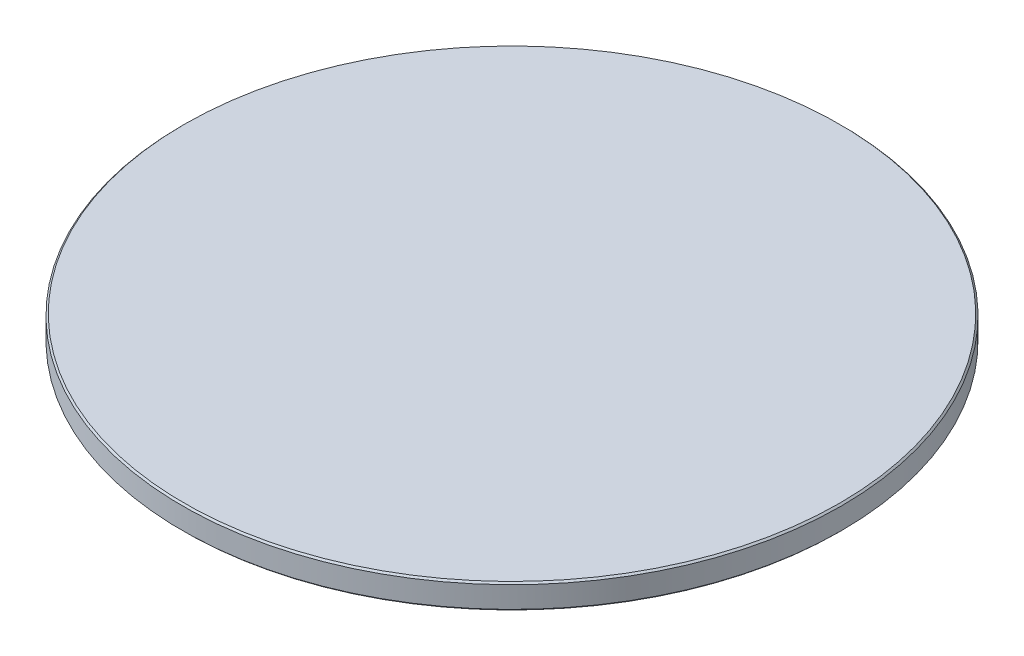
ISO-10303-21;
HEADER;
FILE_DESCRIPTION(('STEP AP214'),'2;1');
FILE_NAME('part.step','',(''),(''),'','','');
FILE_SCHEMA(('AUTOMOTIVE_DESIGN { 1 0 10303 214 1 1 1 1 }'));
ENDSEC;
DATA;
#1=APPLICATION_CONTEXT('core data for automotive mechanical design processes');
#2=APPLICATION_PROTOCOL_DEFINITION('international standard','automotive_design',2000,#1);
#3=PRODUCT_CONTEXT('',#1,'mechanical');
#4=PRODUCT('Part','Part','',(#3));
#5=PRODUCT_RELATED_PRODUCT_CATEGORY('part','',(#4));
#6=PRODUCT_DEFINITION_FORMATION('','',#4);
#7=PRODUCT_DEFINITION_CONTEXT('part definition',#1,'design');
#8=PRODUCT_DEFINITION('design','',#6,#7);
#9=PRODUCT_DEFINITION_SHAPE('','',#8);
#10=(LENGTH_UNIT() NAMED_UNIT(*) SI_UNIT(.MILLI.,.METRE.));
#11=(NAMED_UNIT(*) PLANE_ANGLE_UNIT() SI_UNIT($,.RADIAN.));
#12=(NAMED_UNIT(*) SI_UNIT($,.STERADIAN.) SOLID_ANGLE_UNIT());
#13=UNCERTAINTY_MEASURE_WITH_UNIT(LENGTH_MEASURE(1.E-05),#10,'distance_accuracy_value','');
#14=(GEOMETRIC_REPRESENTATION_CONTEXT(3) GLOBAL_UNCERTAINTY_ASSIGNED_CONTEXT((#13)) GLOBAL_UNIT_ASSIGNED_CONTEXT((#10,
#11,#12)) REPRESENTATION_CONTEXT('',''));
#15=CARTESIAN_POINT('',(0.,0.,0.));
#16=DIRECTION('',(0.,0.,1.));
#17=DIRECTION('',(1.,0.,0.));
#18=AXIS2_PLACEMENT_3D('',#15,#16,#17);
#19=CARTESIAN_POINT('',(0.,2.99999999999999,0.));
#20=DIRECTION('',(0.,1.,0.));
#21=DIRECTION('',(-1.,0.,0.));
#22=AXIS2_PLACEMENT_3D('',#19,#20,#21);
#23=PLANE('',#22);
#24=CARTESIAN_POINT('',(0.,2.99999999999999,0.));
#25=DIRECTION('',(0.,1.,0.));
#26=DIRECTION('',(-1.,0.,0.));
#27=AXIS2_PLACEMENT_3D('',#24,#25,#26);
#28=CIRCLE('',#27,39.8);
#29=CARTESIAN_POINT('',(-39.8,2.99999999999999,0.));
#30=VERTEX_POINT('',#29);
#31=EDGE_CURVE('E10',#30,#30,#28,.T.);
#32=ORIENTED_EDGE('',*,*,#31,.T.);
#33=EDGE_LOOP('',(#32));
#34=FACE_BOUND('',#33,.T.);
#35=ADVANCED_FACE('F39',(#34),#23,.T.);
#36=CARTESIAN_POINT('',(0.,2.99999999999999,0.));
#37=DIRECTION('',(0.,-1.,0.));
#38=DIRECTION('',(1.,0.,0.));
#39=AXIS2_PLACEMENT_3D('',#36,#37,#38);
#40=CONICAL_SURFACE('',#39,39.8,0.785398163397446);
#41=CARTESIAN_POINT('',(0.,2.79999999999999,0.));
#42=DIRECTION('',(0.,1.,0.));
#43=DIRECTION('',(-1.,0.,0.));
#44=AXIS2_PLACEMENT_3D('',#41,#42,#43);
#45=CIRCLE('',#44,40.);
#46=CARTESIAN_POINT('',(-40.,2.8,0.));
#47=VERTEX_POINT('',#46);
#48=EDGE_CURVE('E46',#47,#47,#45,.T.);
#49=ORIENTED_EDGE('',*,*,#48,.T.);
#50=EDGE_LOOP('',(#49));
#51=FACE_BOUND('',#50,.T.);
#52=ORIENTED_EDGE('',*,*,#31,.F.);
#53=EDGE_LOOP('',(#52));
#54=FACE_BOUND('',#53,.T.);
#55=ADVANCED_FACE('F78',(#51,#54),#40,.T.);
#56=CARTESIAN_POINT('',(0.,3.,0.));
#57=DIRECTION('',(0.,1.,0.));
#58=DIRECTION('',(-1.,0.,0.));
#59=AXIS2_PLACEMENT_3D('',#56,#57,#58);
#60=CYLINDRICAL_SURFACE('',#59,40.);
#61=CARTESIAN_POINT('',(0.,0.199999999999991,0.));
#62=DIRECTION('',(0.,1.,0.));
#63=DIRECTION('',(-1.,0.,0.));
#64=AXIS2_PLACEMENT_3D('',#61,#62,#63);
#65=CIRCLE('',#64,40.);
#66=CARTESIAN_POINT('',(-40.,0.199999999999995,0.));
#67=VERTEX_POINT('',#66);
#68=EDGE_CURVE('E53',#67,#67,#65,.T.);
#69=ORIENTED_EDGE('',*,*,#68,.T.);
#70=EDGE_LOOP('',(#69));
#71=FACE_BOUND('',#70,.T.);
#72=ORIENTED_EDGE('',*,*,#48,.F.);
#73=EDGE_LOOP('',(#72));
#74=FACE_BOUND('',#73,.T.);
#75=ADVANCED_FACE('F75',(#71,#74),#60,.T.);
#76=CARTESIAN_POINT('',(0.,0.199999999999991,0.));
#77=DIRECTION('',(0.,1.,0.));
#78=DIRECTION('',(-1.,0.,0.));
#79=AXIS2_PLACEMENT_3D('',#76,#77,#78);
#80=CONICAL_SURFACE('',#79,40.,0.785398163397445);
#81=CARTESIAN_POINT('',(0.,0.,0.));
#82=DIRECTION('',(0.,1.,0.));
#83=DIRECTION('',(-1.,0.,0.));
#84=AXIS2_PLACEMENT_3D('',#81,#82,#83);
#85=CIRCLE('',#84,39.8);
#86=CARTESIAN_POINT('',(-39.8,0.,0.));
#87=VERTEX_POINT('',#86);
#88=EDGE_CURVE('E59',#87,#87,#85,.T.);
#89=ORIENTED_EDGE('',*,*,#88,.T.);
#90=EDGE_LOOP('',(#89));
#91=FACE_BOUND('',#90,.T.);
#92=ORIENTED_EDGE('',*,*,#68,.F.);
#93=EDGE_LOOP('',(#92));
#94=FACE_BOUND('',#93,.T.);
#95=ADVANCED_FACE('F66',(#91,#94),#80,.T.);
#96=CARTESIAN_POINT('',(0.,0.,0.));
#97=DIRECTION('',(0.,-1.,0.));
#98=DIRECTION('',(1.,0.,0.));
#99=AXIS2_PLACEMENT_3D('',#96,#97,#98);
#100=PLANE('',#99);
#101=ORIENTED_EDGE('',*,*,#88,.F.);
#102=EDGE_LOOP('',(#101));
#103=FACE_BOUND('',#102,.T.);
#104=ADVANCED_FACE('F69',(#103),#100,.T.);
#105=CLOSED_SHELL('',(#35,#55,#75,#95,#104));
#106=MANIFOLD_SOLID_BREP('B2',#105);
#107=ADVANCED_BREP_SHAPE_REPRESENTATION('',(#18,#106),#14);
#108=SHAPE_DEFINITION_REPRESENTATION(#9,#107);
ENDSEC;
END-ISO-10303-21;
